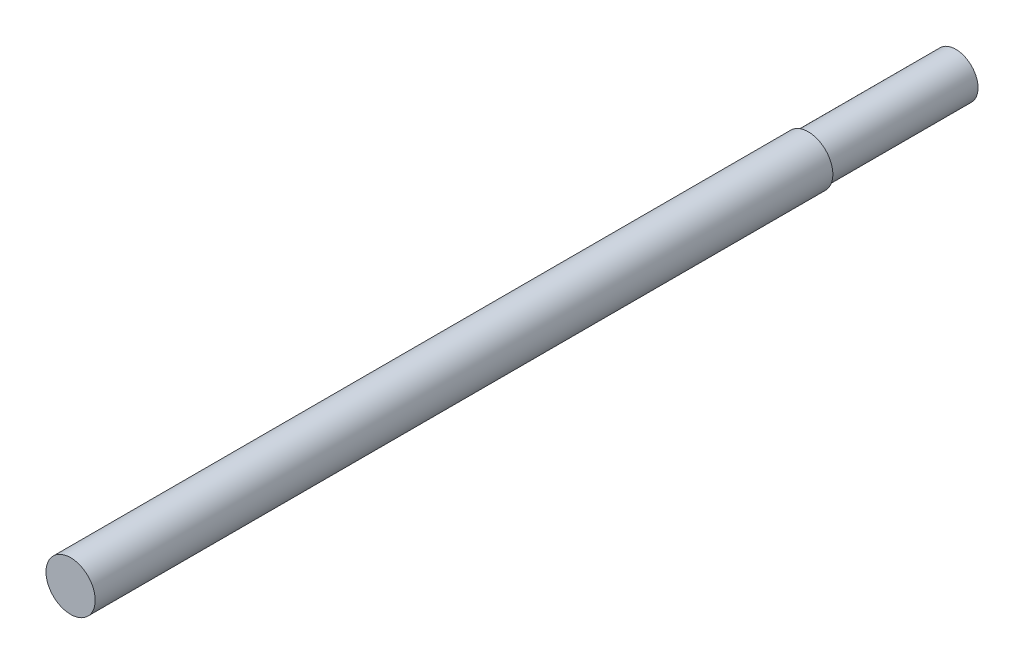
ISO-10303-21;
HEADER;
FILE_DESCRIPTION(('STEP AP214'),'2;1');
FILE_NAME('part.step','',(''),(''),'','','');
FILE_SCHEMA(('AUTOMOTIVE_DESIGN { 1 0 10303 214 1 1 1 1 }'));
ENDSEC;
DATA;
#1=APPLICATION_CONTEXT('core data for automotive mechanical design processes');
#2=APPLICATION_PROTOCOL_DEFINITION('international standard','automotive_design',2000,#1);
#3=PRODUCT_CONTEXT('',#1,'mechanical');
#4=PRODUCT('Part','Part','',(#3));
#5=PRODUCT_RELATED_PRODUCT_CATEGORY('part','',(#4));
#6=PRODUCT_DEFINITION_FORMATION('','',#4);
#7=PRODUCT_DEFINITION_CONTEXT('part definition',#1,'design');
#8=PRODUCT_DEFINITION('design','',#6,#7);
#9=PRODUCT_DEFINITION_SHAPE('','',#8);
#10=(LENGTH_UNIT() NAMED_UNIT(*) SI_UNIT(.MILLI.,.METRE.));
#11=(NAMED_UNIT(*) PLANE_ANGLE_UNIT() SI_UNIT($,.RADIAN.));
#12=(NAMED_UNIT(*) SI_UNIT($,.STERADIAN.) SOLID_ANGLE_UNIT());
#13=UNCERTAINTY_MEASURE_WITH_UNIT(LENGTH_MEASURE(1.E-05),#10,'distance_accuracy_value','');
#14=(GEOMETRIC_REPRESENTATION_CONTEXT(3) GLOBAL_UNCERTAINTY_ASSIGNED_CONTEXT((#13)) GLOBAL_UNIT_ASSIGNED_CONTEXT((#10,
#11,#12)) REPRESENTATION_CONTEXT('',''));
#15=CARTESIAN_POINT('',(0.,0.,0.));
#16=DIRECTION('',(0.,0.,1.));
#17=DIRECTION('',(1.,0.,0.));
#18=AXIS2_PLACEMENT_3D('',#15,#16,#17);
#19=CARTESIAN_POINT('',(0.,0.,-457.2));
#20=DIRECTION('',(0.,0.,1.));
#21=DIRECTION('',(1.,0.,0.));
#22=AXIS2_PLACEMENT_3D('',#19,#20,#21);
#23=PLANE('',#22);
#24=CARTESIAN_POINT('',(0.,0.,-457.2));
#25=DIRECTION('',(0.,0.,1.));
#26=DIRECTION('',(1.,0.,0.));
#27=AXIS2_PLACEMENT_3D('',#24,#25,#26);
#28=CIRCLE('',#27,9.525);
#29=CARTESIAN_POINT('',(9.525,0.,-457.2));
#30=VERTEX_POINT('',#29);
#31=EDGE_CURVE('E56',#30,#30,#28,.T.);
#32=ORIENTED_EDGE('',*,*,#31,.T.);
#33=EDGE_LOOP('',(#32));
#34=FACE_BOUND('',#33,.T.);
#35=CARTESIAN_POINT('',(0.,0.,-457.2));
#36=DIRECTION('',(0.,0.,-1.));
#37=DIRECTION('',(-1.,0.,0.));
#38=AXIS2_PLACEMENT_3D('',#35,#36,#37);
#39=CIRCLE('',#38,23.);
#40=CARTESIAN_POINT('',(-23.,0.,-457.2));
#41=VERTEX_POINT('',#40);
#42=EDGE_CURVE('E68',#41,#41,#39,.T.);
#43=ORIENTED_EDGE('',*,*,#42,.T.);
#44=EDGE_LOOP('',(#43));
#45=FACE_BOUND('',#44,.T.);
#46=ADVANCED_FACE('F43',(#34,#45),#23,.F.);
#47=CARTESIAN_POINT('',(0.,0.,-438.15));
#48=DIRECTION('',(0.,0.,-1.));
#49=DIRECTION('',(-1.,0.,0.));
#50=AXIS2_PLACEMENT_3D('',#47,#48,#49);
#51=CYLINDRICAL_SURFACE('',#50,9.525);
#52=CARTESIAN_POINT('',(0.,0.,-438.15));
#53=DIRECTION('',(0.,0.,1.));
#54=DIRECTION('',(1.,0.,0.));
#55=AXIS2_PLACEMENT_3D('',#52,#53,#54);
#56=CIRCLE('',#55,9.525);
#57=CARTESIAN_POINT('',(9.525,0.,-438.15));
#58=VERTEX_POINT('',#57);
#59=EDGE_CURVE('E51',#58,#58,#56,.T.);
#60=ORIENTED_EDGE('',*,*,#59,.T.);
#61=EDGE_LOOP('',(#60));
#62=FACE_BOUND('',#61,.T.);
#63=ORIENTED_EDGE('',*,*,#31,.F.);
#64=EDGE_LOOP('',(#63));
#65=FACE_BOUND('',#64,.T.);
#66=ADVANCED_FACE('F93',(#62,#65),#51,.F.);
#67=CARTESIAN_POINT('',(0.,0.,-438.15));
#68=DIRECTION('',(0.,0.,1.));
#69=DIRECTION('',(1.,0.,0.));
#70=AXIS2_PLACEMENT_3D('',#67,#68,#69);
#71=PLANE('',#70);
#72=ORIENTED_EDGE('',*,*,#59,.F.);
#73=EDGE_LOOP('',(#72));
#74=FACE_BOUND('',#73,.T.);
#75=ADVANCED_FACE('F82',(#74),#71,.F.);
#76=CARTESIAN_POINT('',(0.,0.,-304.8));
#77=DIRECTION('',(0.,0.,-1.));
#78=DIRECTION('',(-1.,0.,0.));
#79=AXIS2_PLACEMENT_3D('',#76,#77,#78);
#80=PLANE('',#79);
#81=CARTESIAN_POINT('',(0.,0.,-304.8));
#82=DIRECTION('',(0.,0.,-1.));
#83=DIRECTION('',(-1.,0.,0.));
#84=AXIS2_PLACEMENT_3D('',#81,#82,#83);
#85=CIRCLE('',#84,23.);
#86=CARTESIAN_POINT('',(-23.,0.,-304.8));
#87=VERTEX_POINT('',#86);
#88=EDGE_CURVE('E67',#87,#87,#85,.T.);
#89=ORIENTED_EDGE('',*,*,#88,.F.);
#90=EDGE_LOOP('',(#89));
#91=FACE_BOUND('',#90,.T.);
#92=CARTESIAN_POINT('',(0.,0.,-304.8));
#93=DIRECTION('',(0.,0.,-1.));
#94=DIRECTION('',(-1.,0.,0.));
#95=AXIS2_PLACEMENT_3D('',#92,#93,#94);
#96=CIRCLE('',#95,25.4);
#97=CARTESIAN_POINT('',(-25.4,0.,-304.8));
#98=VERTEX_POINT('',#97);
#99=EDGE_CURVE('E62',#98,#98,#96,.T.);
#100=ORIENTED_EDGE('',*,*,#99,.T.);
#101=EDGE_LOOP('',(#100));
#102=FACE_BOUND('',#101,.T.);
#103=ADVANCED_FACE('F79',(#91,#102),#80,.T.);
#104=CARTESIAN_POINT('',(0.,0.,-304.8));
#105=DIRECTION('',(0.,0.,-1.));
#106=DIRECTION('',(-1.,0.,0.));
#107=AXIS2_PLACEMENT_3D('',#104,#105,#106);
#108=CYLINDRICAL_SURFACE('',#107,23.);
#109=ORIENTED_EDGE('',*,*,#88,.T.);
#110=EDGE_LOOP('',(#109));
#111=FACE_BOUND('',#110,.T.);
#112=ORIENTED_EDGE('',*,*,#42,.F.);
#113=EDGE_LOOP('',(#112));
#114=FACE_BOUND('',#113,.T.);
#115=ADVANCED_FACE('F76',(#111,#114),#108,.T.);
#116=CARTESIAN_POINT('',(0.,0.,457.2));
#117=DIRECTION('',(0.,0.,1.));
#118=DIRECTION('',(1.,0.,0.));
#119=AXIS2_PLACEMENT_3D('',#116,#117,#118);
#120=PLANE('',#119);
#121=CARTESIAN_POINT('',(0.,0.,457.2));
#122=DIRECTION('',(0.,0.,1.));
#123=DIRECTION('',(1.,0.,0.));
#124=AXIS2_PLACEMENT_3D('',#121,#122,#123);
#125=CIRCLE('',#124,25.4);
#126=CARTESIAN_POINT('',(25.4,0.,457.2));
#127=VERTEX_POINT('',#126);
#128=EDGE_CURVE('E11',#127,#127,#125,.T.);
#129=ORIENTED_EDGE('',*,*,#128,.T.);
#130=EDGE_LOOP('',(#129));
#131=FACE_BOUND('',#130,.T.);
#132=ADVANCED_FACE('F87',(#131),#120,.T.);
#133=CARTESIAN_POINT('',(0.,0.,457.2));
#134=DIRECTION('',(0.,0.,-1.));
#135=DIRECTION('',(-1.,0.,0.));
#136=AXIS2_PLACEMENT_3D('',#133,#134,#135);
#137=CYLINDRICAL_SURFACE('',#136,25.4);
#138=ORIENTED_EDGE('',*,*,#128,.F.);
#139=EDGE_LOOP('',(#138));
#140=FACE_BOUND('',#139,.T.);
#141=ORIENTED_EDGE('',*,*,#99,.F.);
#142=EDGE_LOOP('',(#141));
#143=FACE_BOUND('',#142,.T.);
#144=ADVANCED_FACE('F45',(#140,#143),#137,.T.);
#145=CLOSED_SHELL('',(#46,#66,#75,#103,#115,#132,#144));
#146=MANIFOLD_SOLID_BREP('B2',#145);
#147=ADVANCED_BREP_SHAPE_REPRESENTATION('',(#18,#146),#14);
#148=SHAPE_DEFINITION_REPRESENTATION(#9,#147);
ENDSEC;
END-ISO-10303-21;
